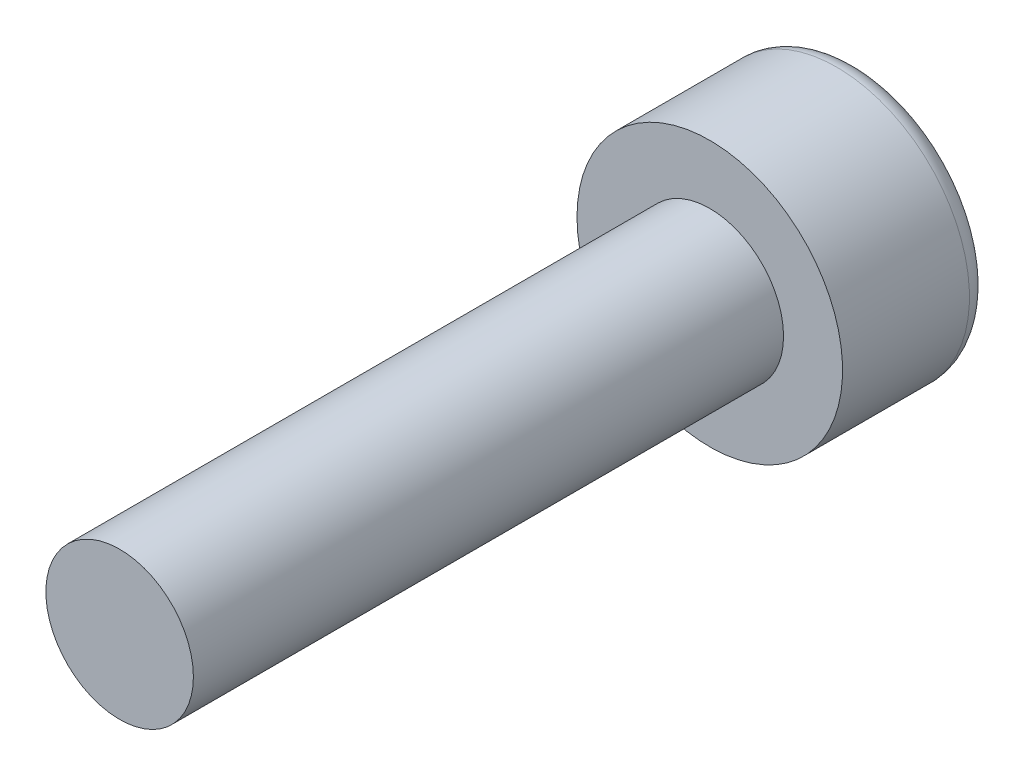
ISO-10303-21;
HEADER;
FILE_DESCRIPTION(('STEP AP214'),'2;1');
FILE_NAME('part.step','',(''),(''),'','','');
FILE_SCHEMA(('AUTOMOTIVE_DESIGN { 1 0 10303 214 1 1 1 1 }'));
ENDSEC;
DATA;
#1=APPLICATION_CONTEXT('core data for automotive mechanical design processes');
#2=APPLICATION_PROTOCOL_DEFINITION('international standard','automotive_design',2000,#1);
#3=PRODUCT_CONTEXT('',#1,'mechanical');
#4=PRODUCT('Part','Part','',(#3));
#5=PRODUCT_RELATED_PRODUCT_CATEGORY('part','',(#4));
#6=PRODUCT_DEFINITION_FORMATION('','',#4);
#7=PRODUCT_DEFINITION_CONTEXT('part definition',#1,'design');
#8=PRODUCT_DEFINITION('design','',#6,#7);
#9=PRODUCT_DEFINITION_SHAPE('','',#8);
#10=(LENGTH_UNIT() NAMED_UNIT(*) SI_UNIT(.MILLI.,.METRE.));
#11=(NAMED_UNIT(*) PLANE_ANGLE_UNIT() SI_UNIT($,.RADIAN.));
#12=(NAMED_UNIT(*) SI_UNIT($,.STERADIAN.) SOLID_ANGLE_UNIT());
#13=UNCERTAINTY_MEASURE_WITH_UNIT(LENGTH_MEASURE(1.E-05),#10,'distance_accuracy_value','');
#14=(GEOMETRIC_REPRESENTATION_CONTEXT(3) GLOBAL_UNCERTAINTY_ASSIGNED_CONTEXT((#13)) GLOBAL_UNIT_ASSIGNED_CONTEXT((#10,
#11,#12)) REPRESENTATION_CONTEXT('',''));
#15=CARTESIAN_POINT('',(0.,0.,0.));
#16=DIRECTION('',(0.,0.,1.));
#17=DIRECTION('',(1.,0.,0.));
#18=AXIS2_PLACEMENT_3D('',#15,#16,#17);
#19=CARTESIAN_POINT('',(0.,0.,10.));
#20=DIRECTION('',(0.,0.,-1.));
#21=DIRECTION('',(-1.,0.,0.));
#22=AXIS2_PLACEMENT_3D('',#19,#20,#21);
#23=CYLINDRICAL_SURFACE('',#22,1.25);
#24=CARTESIAN_POINT('',(0.,0.,10.));
#25=DIRECTION('',(0.,0.,1.));
#26=DIRECTION('',(1.,0.,0.));
#27=AXIS2_PLACEMENT_3D('',#24,#25,#26);
#28=CIRCLE('',#27,1.25);
#29=CARTESIAN_POINT('',(1.25,0.,10.));
#30=VERTEX_POINT('',#29);
#31=EDGE_CURVE('E145',#30,#30,#28,.T.);
#32=ORIENTED_EDGE('',*,*,#31,.F.);
#33=EDGE_LOOP('',(#32));
#34=FACE_BOUND('',#33,.T.);
#35=CARTESIAN_POINT('',(0.,0.,0.));
#36=DIRECTION('',(0.,0.,1.));
#37=DIRECTION('',(1.,0.,0.));
#38=AXIS2_PLACEMENT_3D('',#35,#36,#37);
#39=CIRCLE('',#38,1.25);
#40=CARTESIAN_POINT('',(1.25,0.,0.));
#41=VERTEX_POINT('',#40);
#42=EDGE_CURVE('E144',#41,#41,#39,.T.);
#43=ORIENTED_EDGE('',*,*,#42,.T.);
#44=EDGE_LOOP('',(#43));
#45=FACE_BOUND('',#44,.T.);
#46=ADVANCED_FACE('F34',(#34,#45),#23,.T.);
#47=CARTESIAN_POINT('',(0.,0.,10.));
#48=DIRECTION('',(0.,0.,1.));
#49=DIRECTION('',(1.,0.,0.));
#50=AXIS2_PLACEMENT_3D('',#47,#48,#49);
#51=PLANE('',#50);
#52=ORIENTED_EDGE('',*,*,#31,.T.);
#53=EDGE_LOOP('',(#52));
#54=FACE_BOUND('',#53,.T.);
#55=ADVANCED_FACE('F164',(#54),#51,.T.);
#56=CARTESIAN_POINT('',(0.,0.,-2.5));
#57=DIRECTION('',(0.,0.,1.));
#58=DIRECTION('',(1.,0.,0.));
#59=AXIS2_PLACEMENT_3D('',#56,#57,#58);
#60=CYLINDRICAL_SURFACE('',#59,2.25);
#61=CARTESIAN_POINT('',(0.,0.,-2.15));
#62=DIRECTION('',(0.,0.,-1.));
#63=DIRECTION('',(-1.,0.,0.));
#64=AXIS2_PLACEMENT_3D('',#61,#62,#63);
#65=CIRCLE('',#64,2.25);
#66=CARTESIAN_POINT('',(-2.25,0.,-2.15));
#67=VERTEX_POINT('',#66);
#68=EDGE_CURVE('E11',#67,#67,#65,.F.);
#69=ORIENTED_EDGE('',*,*,#68,.T.);
#70=EDGE_LOOP('',(#69));
#71=FACE_BOUND('',#70,.T.);
#72=CARTESIAN_POINT('',(0.,0.,0.));
#73=DIRECTION('',(0.,0.,-1.));
#74=DIRECTION('',(-1.,0.,0.));
#75=AXIS2_PLACEMENT_3D('',#72,#73,#74);
#76=CIRCLE('',#75,2.25);
#77=CARTESIAN_POINT('',(-2.25,0.,0.));
#78=VERTEX_POINT('',#77);
#79=EDGE_CURVE('E136',#78,#78,#76,.T.);
#80=ORIENTED_EDGE('',*,*,#79,.T.);
#81=EDGE_LOOP('',(#80));
#82=FACE_BOUND('',#81,.T.);
#83=ADVANCED_FACE('F169',(#71,#82),#60,.T.);
#84=CARTESIAN_POINT('',(0.,0.,-2.5));
#85=DIRECTION('',(0.,0.,-1.));
#86=DIRECTION('',(-1.,0.,0.));
#87=AXIS2_PLACEMENT_3D('',#84,#85,#86);
#88=PLANE('',#87);
#89=CARTESIAN_POINT('',(0.,0.,-2.5));
#90=DIRECTION('',(0.,0.,-1.));
#91=DIRECTION('',(-1.,0.,0.));
#92=AXIS2_PLACEMENT_3D('',#89,#90,#91);
#93=CIRCLE('',#92,1.9);
#94=CARTESIAN_POINT('',(-1.9,0.,-2.5));
#95=VERTEX_POINT('',#94);
#96=EDGE_CURVE('E42',#95,#95,#93,.T.);
#97=ORIENTED_EDGE('',*,*,#96,.T.);
#98=EDGE_LOOP('',(#97));
#99=FACE_BOUND('',#98,.T.);
#100=DIRECTION('',(-0.866025403784439,-0.5,0.));
#101=VECTOR('',#100,1.);
#102=CARTESIAN_POINT('',(1.,-0.577350269189626,-2.5));
#103=LINE('',#102,#101);
#104=CARTESIAN_POINT('',(1.,-0.577350269189626,-2.5));
#105=VERTEX_POINT('',#104);
#106=CARTESIAN_POINT('',(0.,-1.15470053837925,-2.5));
#107=VERTEX_POINT('',#106);
#108=EDGE_CURVE('E49',#105,#107,#103,.T.);
#109=ORIENTED_EDGE('',*,*,#108,.F.);
#110=DIRECTION('',(0.,-1.,0.));
#111=VECTOR('',#110,1.);
#112=CARTESIAN_POINT('',(1.,0.577350269189626,-2.5));
#113=LINE('',#112,#111);
#114=CARTESIAN_POINT('',(1.,0.577350269189626,-2.5));
#115=VERTEX_POINT('',#114);
#116=EDGE_CURVE('E132',#115,#105,#113,.T.);
#117=ORIENTED_EDGE('',*,*,#116,.F.);
#118=DIRECTION('',(0.866025403784439,-0.5,0.));
#119=VECTOR('',#118,1.);
#120=CARTESIAN_POINT('',(0.,1.15470053837925,-2.5));
#121=LINE('',#120,#119);
#122=CARTESIAN_POINT('',(0.,1.15470053837925,-2.5));
#123=VERTEX_POINT('',#122);
#124=EDGE_CURVE('E130',#123,#115,#121,.T.);
#125=ORIENTED_EDGE('',*,*,#124,.F.);
#126=DIRECTION('',(0.866025403784439,0.5,0.));
#127=VECTOR('',#126,1.);
#128=CARTESIAN_POINT('',(-1.,0.577350269189626,-2.5));
#129=LINE('',#128,#127);
#130=CARTESIAN_POINT('',(-1.,0.577350269189626,-2.5));
#131=VERTEX_POINT('',#130);
#132=EDGE_CURVE('E97',#131,#123,#129,.T.);
#133=ORIENTED_EDGE('',*,*,#132,.F.);
#134=DIRECTION('',(0.,1.,0.));
#135=VECTOR('',#134,1.);
#136=CARTESIAN_POINT('',(-1.,-0.577350269189626,-2.5));
#137=LINE('',#136,#135);
#138=CARTESIAN_POINT('',(-1.,-0.577350269189626,-2.5));
#139=VERTEX_POINT('',#138);
#140=EDGE_CURVE('E126',#139,#131,#137,.T.);
#141=ORIENTED_EDGE('',*,*,#140,.F.);
#142=DIRECTION('',(-0.866025403784438,0.5,0.));
#143=VECTOR('',#142,1.);
#144=CARTESIAN_POINT('',(0.,-1.15470053837925,-2.5));
#145=LINE('',#144,#143);
#146=EDGE_CURVE('E123',#107,#139,#145,.T.);
#147=ORIENTED_EDGE('',*,*,#146,.F.);
#148=EDGE_LOOP('',(#109,#117,#125,#133,#141,#147));
#149=FACE_BOUND('',#148,.T.);
#150=ADVANCED_FACE('F152',(#99,#149),#88,.T.);
#151=CARTESIAN_POINT('',(0.,0.,0.));
#152=DIRECTION('',(0.,0.,-1.));
#153=DIRECTION('',(-1.,0.,0.));
#154=AXIS2_PLACEMENT_3D('',#151,#152,#153);
#155=PLANE('',#154);
#156=ORIENTED_EDGE('',*,*,#42,.F.);
#157=EDGE_LOOP('',(#156));
#158=FACE_BOUND('',#157,.T.);
#159=ORIENTED_EDGE('',*,*,#79,.F.);
#160=EDGE_LOOP('',(#159));
#161=FACE_BOUND('',#160,.T.);
#162=ADVANCED_FACE('F178',(#158,#161),#155,.F.);
#163=CARTESIAN_POINT('',(1.,-0.577350269189626,-1.));
#164=DIRECTION('',(0.5,-0.866025403784438,0.));
#165=DIRECTION('',(0.866025403784439,0.5,0.));
#166=AXIS2_PLACEMENT_3D('',#163,#164,#165);
#167=PLANE('',#166);
#168=ORIENTED_EDGE('',*,*,#108,.T.);
#169=DIRECTION('',(0.,0.,-1.));
#170=VECTOR('',#169,1.);
#171=CARTESIAN_POINT('',(0.,-1.15470053837925,-1.));
#172=LINE('',#171,#170);
#173=CARTESIAN_POINT('',(0.,-1.15470053837925,-1.));
#174=VERTEX_POINT('',#173);
#175=EDGE_CURVE('E79',#174,#107,#172,.T.);
#176=ORIENTED_EDGE('',*,*,#175,.F.);
#177=DIRECTION('',(-0.866025403784439,-0.5,0.));
#178=VECTOR('',#177,1.);
#179=CARTESIAN_POINT('',(1.,-0.577350269189626,-1.));
#180=LINE('',#179,#178);
#181=CARTESIAN_POINT('',(1.,-0.577350269189626,-1.));
#182=VERTEX_POINT('',#181);
#183=EDGE_CURVE('E134',#182,#174,#180,.T.);
#184=ORIENTED_EDGE('',*,*,#183,.F.);
#185=DIRECTION('',(0.,0.,-1.));
#186=VECTOR('',#185,1.);
#187=CARTESIAN_POINT('',(1.,-0.577350269189626,-1.));
#188=LINE('',#187,#186);
#189=EDGE_CURVE('E57',#182,#105,#188,.T.);
#190=ORIENTED_EDGE('',*,*,#189,.T.);
#191=EDGE_LOOP('',(#168,#176,#184,#190));
#192=FACE_BOUND('',#191,.T.);
#193=ADVANCED_FACE('F181',(#192),#167,.F.);
#194=CARTESIAN_POINT('',(1.,0.577350269189626,-1.));
#195=DIRECTION('',(1.,0.,0.));
#196=DIRECTION('',(0.,1.,0.));
#197=AXIS2_PLACEMENT_3D('',#194,#195,#196);
#198=PLANE('',#197);
#199=ORIENTED_EDGE('',*,*,#116,.T.);
#200=ORIENTED_EDGE('',*,*,#189,.F.);
#201=DIRECTION('',(0.,-1.,0.));
#202=VECTOR('',#201,1.);
#203=CARTESIAN_POINT('',(1.,0.577350269189626,-1.));
#204=LINE('',#203,#202);
#205=CARTESIAN_POINT('',(1.,0.577350269189626,-1.));
#206=VERTEX_POINT('',#205);
#207=EDGE_CURVE('E109',#206,#182,#204,.T.);
#208=ORIENTED_EDGE('',*,*,#207,.F.);
#209=DIRECTION('',(0.,0.,-1.));
#210=VECTOR('',#209,1.);
#211=CARTESIAN_POINT('',(1.,0.577350269189626,-1.));
#212=LINE('',#211,#210);
#213=EDGE_CURVE('E101',#206,#115,#212,.T.);
#214=ORIENTED_EDGE('',*,*,#213,.T.);
#215=EDGE_LOOP('',(#199,#200,#208,#214));
#216=FACE_BOUND('',#215,.T.);
#217=ADVANCED_FACE('F187',(#216),#198,.F.);
#218=CARTESIAN_POINT('',(0.,1.15470053837925,-1.));
#219=DIRECTION('',(0.5,0.866025403784439,0.));
#220=DIRECTION('',(-0.866025403784439,0.5,0.));
#221=AXIS2_PLACEMENT_3D('',#218,#219,#220);
#222=PLANE('',#221);
#223=ORIENTED_EDGE('',*,*,#124,.T.);
#224=ORIENTED_EDGE('',*,*,#213,.F.);
#225=DIRECTION('',(0.866025403784439,-0.5,0.));
#226=VECTOR('',#225,1.);
#227=CARTESIAN_POINT('',(0.,1.15470053837925,-1.));
#228=LINE('',#227,#226);
#229=CARTESIAN_POINT('',(0.,1.15470053837925,-1.));
#230=VERTEX_POINT('',#229);
#231=EDGE_CURVE('E105',#230,#206,#228,.T.);
#232=ORIENTED_EDGE('',*,*,#231,.F.);
#233=DIRECTION('',(0.,0.,-1.));
#234=VECTOR('',#233,1.);
#235=CARTESIAN_POINT('',(0.,1.15470053837925,-1.));
#236=LINE('',#235,#234);
#237=EDGE_CURVE('E90',#230,#123,#236,.T.);
#238=ORIENTED_EDGE('',*,*,#237,.T.);
#239=EDGE_LOOP('',(#223,#224,#232,#238));
#240=FACE_BOUND('',#239,.T.);
#241=ADVANCED_FACE('F106',(#240),#222,.F.);
#242=CARTESIAN_POINT('',(-1.,0.577350269189626,-1.));
#243=DIRECTION('',(-0.5,0.866025403784439,0.));
#244=DIRECTION('',(-0.866025403784439,-0.5,0.));
#245=AXIS2_PLACEMENT_3D('',#242,#243,#244);
#246=PLANE('',#245);
#247=ORIENTED_EDGE('',*,*,#132,.T.);
#248=ORIENTED_EDGE('',*,*,#237,.F.);
#249=DIRECTION('',(0.866025403784439,0.5,0.));
#250=VECTOR('',#249,1.);
#251=CARTESIAN_POINT('',(-1.,0.577350269189626,-1.));
#252=LINE('',#251,#250);
#253=CARTESIAN_POINT('',(-1.,0.577350269189626,-1.));
#254=VERTEX_POINT('',#253);
#255=EDGE_CURVE('E94',#254,#230,#252,.T.);
#256=ORIENTED_EDGE('',*,*,#255,.F.);
#257=DIRECTION('',(0.,0.,-1.));
#258=VECTOR('',#257,1.);
#259=CARTESIAN_POINT('',(-1.,0.577350269189626,-1.));
#260=LINE('',#259,#258);
#261=EDGE_CURVE('E102',#254,#131,#260,.T.);
#262=ORIENTED_EDGE('',*,*,#261,.T.);
#263=EDGE_LOOP('',(#247,#248,#256,#262));
#264=FACE_BOUND('',#263,.T.);
#265=ADVANCED_FACE('F92',(#264),#246,.F.);
#266=CARTESIAN_POINT('',(-1.,-0.577350269189626,-1.));
#267=DIRECTION('',(-1.,0.,0.));
#268=DIRECTION('',(0.,0.,1.));
#269=AXIS2_PLACEMENT_3D('',#266,#267,#268);
#270=PLANE('',#269);
#271=ORIENTED_EDGE('',*,*,#140,.T.);
#272=ORIENTED_EDGE('',*,*,#261,.F.);
#273=DIRECTION('',(0.,1.,0.));
#274=VECTOR('',#273,1.);
#275=CARTESIAN_POINT('',(-1.,-0.577350269189626,-1.));
#276=LINE('',#275,#274);
#277=CARTESIAN_POINT('',(-1.,-0.577350269189626,-1.));
#278=VERTEX_POINT('',#277);
#279=EDGE_CURVE('E115',#278,#254,#276,.T.);
#280=ORIENTED_EDGE('',*,*,#279,.F.);
#281=DIRECTION('',(0.,0.,-1.));
#282=VECTOR('',#281,1.);
#283=CARTESIAN_POINT('',(-1.,-0.577350269189626,-1.));
#284=LINE('',#283,#282);
#285=EDGE_CURVE('E139',#278,#139,#284,.T.);
#286=ORIENTED_EDGE('',*,*,#285,.T.);
#287=EDGE_LOOP('',(#271,#272,#280,#286));
#288=FACE_BOUND('',#287,.T.);
#289=ADVANCED_FACE('F190',(#288),#270,.F.);
#290=CARTESIAN_POINT('',(0.,-1.15470053837925,-1.));
#291=DIRECTION('',(-0.5,-0.866025403784439,0.));
#292=DIRECTION('',(0.866025403784439,-0.5,0.));
#293=AXIS2_PLACEMENT_3D('',#290,#291,#292);
#294=PLANE('',#293);
#295=ORIENTED_EDGE('',*,*,#146,.T.);
#296=ORIENTED_EDGE('',*,*,#285,.F.);
#297=DIRECTION('',(-0.866025403784438,0.5,0.));
#298=VECTOR('',#297,1.);
#299=CARTESIAN_POINT('',(0.,-1.15470053837925,-1.));
#300=LINE('',#299,#298);
#301=EDGE_CURVE('E117',#174,#278,#300,.T.);
#302=ORIENTED_EDGE('',*,*,#301,.F.);
#303=ORIENTED_EDGE('',*,*,#175,.T.);
#304=EDGE_LOOP('',(#295,#296,#302,#303));
#305=FACE_BOUND('',#304,.T.);
#306=ADVANCED_FACE('F160',(#305),#294,.F.);
#307=CARTESIAN_POINT('',(0.,0.,-1.));
#308=DIRECTION('',(0.,0.,-1.));
#309=DIRECTION('',(-1.,0.,0.));
#310=AXIS2_PLACEMENT_3D('',#307,#308,#309);
#311=PLANE('',#310);
#312=ORIENTED_EDGE('',*,*,#183,.T.);
#313=ORIENTED_EDGE('',*,*,#301,.T.);
#314=ORIENTED_EDGE('',*,*,#279,.T.);
#315=ORIENTED_EDGE('',*,*,#255,.T.);
#316=ORIENTED_EDGE('',*,*,#231,.T.);
#317=ORIENTED_EDGE('',*,*,#207,.T.);
#318=EDGE_LOOP('',(#312,#313,#314,#315,#316,#317));
#319=FACE_BOUND('',#318,.T.);
#320=ADVANCED_FACE('F112',(#319),#311,.T.);
#321=CARTESIAN_POINT('',(0.,0.,-2.15));
#322=DIRECTION('',(0.,0.,-1.));
#323=DIRECTION('',(-1.,0.,0.));
#324=AXIS2_PLACEMENT_3D('',#321,#322,#323);
#325=TOROIDAL_SURFACE('',#324,1.9,0.35);
#326=ORIENTED_EDGE('',*,*,#68,.F.);
#327=EDGE_LOOP('',(#326));
#328=FACE_BOUND('',#327,.T.);
#329=ORIENTED_EDGE('',*,*,#96,.F.);
#330=EDGE_LOOP('',(#329));
#331=FACE_BOUND('',#330,.T.);
#332=ADVANCED_FACE('F36',(#328,#331),#325,.T.);
#333=CLOSED_SHELL('',(#46,#55,#83,#150,#162,#193,#217,#241,#265,#289,#306,#320,#332));
#334=MANIFOLD_SOLID_BREP('B2',#333);
#335=ADVANCED_BREP_SHAPE_REPRESENTATION('',(#18,#334),#14);
#336=SHAPE_DEFINITION_REPRESENTATION(#9,#335);
ENDSEC;
END-ISO-10303-21;
